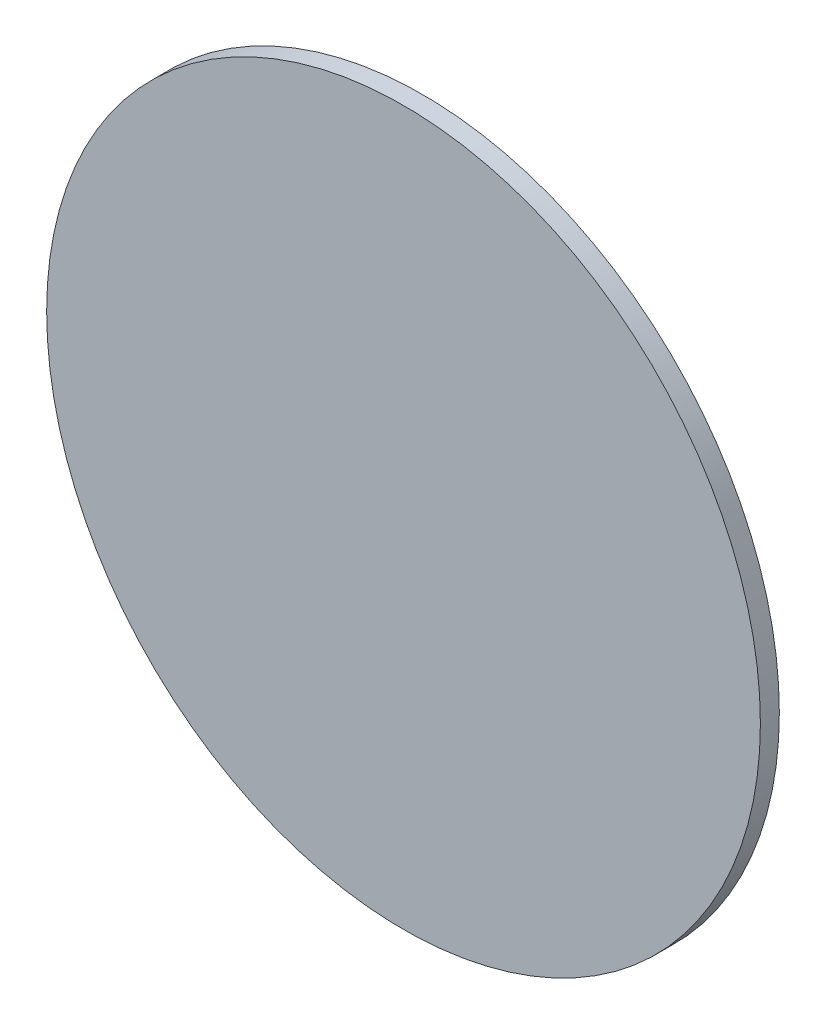
ISO-10303-21;
HEADER;
FILE_DESCRIPTION(('STEP AP214'),'2;1');
FILE_NAME('part.step','',(''),(''),'','','');
FILE_SCHEMA(('AUTOMOTIVE_DESIGN { 1 0 10303 214 1 1 1 1 }'));
ENDSEC;
DATA;
#1=APPLICATION_CONTEXT('core data for automotive mechanical design processes');
#2=APPLICATION_PROTOCOL_DEFINITION('international standard','automotive_design',2000,#1);
#3=PRODUCT_CONTEXT('',#1,'mechanical');
#4=PRODUCT('Part','Part','',(#3));
#5=PRODUCT_RELATED_PRODUCT_CATEGORY('part','',(#4));
#6=PRODUCT_DEFINITION_FORMATION('','',#4);
#7=PRODUCT_DEFINITION_CONTEXT('part definition',#1,'design');
#8=PRODUCT_DEFINITION('design','',#6,#7);
#9=PRODUCT_DEFINITION_SHAPE('','',#8);
#10=(LENGTH_UNIT() NAMED_UNIT(*) SI_UNIT(.MILLI.,.METRE.));
#11=(NAMED_UNIT(*) PLANE_ANGLE_UNIT() SI_UNIT($,.RADIAN.));
#12=(NAMED_UNIT(*) SI_UNIT($,.STERADIAN.) SOLID_ANGLE_UNIT());
#13=UNCERTAINTY_MEASURE_WITH_UNIT(LENGTH_MEASURE(1.E-05),#10,'distance_accuracy_value','');
#14=(GEOMETRIC_REPRESENTATION_CONTEXT(3) GLOBAL_UNCERTAINTY_ASSIGNED_CONTEXT((#13)) GLOBAL_UNIT_ASSIGNED_CONTEXT((#10,
#11,#12)) REPRESENTATION_CONTEXT('',''));
#15=CARTESIAN_POINT('',(0.,0.,0.));
#16=DIRECTION('',(0.,0.,1.));
#17=DIRECTION('',(1.,0.,0.));
#18=AXIS2_PLACEMENT_3D('',#15,#16,#17);
#19=CARTESIAN_POINT('',(0.,0.,6.8));
#20=DIRECTION('',(0.,0.,-1.));
#21=DIRECTION('',(-1.,0.,0.));
#22=AXIS2_PLACEMENT_3D('',#19,#20,#21);
#23=CYLINDRICAL_SURFACE('',#22,128.);
#24=CARTESIAN_POINT('',(0.,0.,6.8));
#25=DIRECTION('',(0.,0.,1.));
#26=DIRECTION('',(1.,0.,0.));
#27=AXIS2_PLACEMENT_3D('',#24,#25,#26);
#28=CIRCLE('',#27,128.);
#29=CARTESIAN_POINT('',(128.,0.,6.8));
#30=VERTEX_POINT('',#29);
#31=EDGE_CURVE('E10',#30,#30,#28,.T.);
#32=ORIENTED_EDGE('',*,*,#31,.F.);
#33=EDGE_LOOP('',(#32));
#34=FACE_BOUND('',#33,.T.);
#35=CARTESIAN_POINT('',(0.,0.,0.));
#36=DIRECTION('',(0.,0.,1.));
#37=DIRECTION('',(1.,0.,0.));
#38=AXIS2_PLACEMENT_3D('',#35,#36,#37);
#39=CIRCLE('',#38,128.);
#40=CARTESIAN_POINT('',(128.,0.,0.));
#41=VERTEX_POINT('',#40);
#42=EDGE_CURVE('E36',#41,#41,#39,.T.);
#43=ORIENTED_EDGE('',*,*,#42,.T.);
#44=EDGE_LOOP('',(#43));
#45=FACE_BOUND('',#44,.T.);
#46=ADVANCED_FACE('F33',(#34,#45),#23,.T.);
#47=CARTESIAN_POINT('',(0.,0.,6.8));
#48=DIRECTION('',(0.,0.,1.));
#49=DIRECTION('',(1.,0.,0.));
#50=AXIS2_PLACEMENT_3D('',#47,#48,#49);
#51=PLANE('',#50);
#52=ORIENTED_EDGE('',*,*,#31,.T.);
#53=EDGE_LOOP('',(#52));
#54=FACE_BOUND('',#53,.T.);
#55=ADVANCED_FACE('F48',(#54),#51,.T.);
#56=CARTESIAN_POINT('',(0.,0.,0.));
#57=DIRECTION('',(0.,0.,1.));
#58=DIRECTION('',(1.,0.,0.));
#59=AXIS2_PLACEMENT_3D('',#56,#57,#58);
#60=PLANE('',#59);
#61=ORIENTED_EDGE('',*,*,#42,.F.);
#62=EDGE_LOOP('',(#61));
#63=FACE_BOUND('',#62,.T.);
#64=ADVANCED_FACE('F46',(#63),#60,.F.);
#65=CLOSED_SHELL('',(#46,#55,#64));
#66=MANIFOLD_SOLID_BREP('B2',#65);
#67=ADVANCED_BREP_SHAPE_REPRESENTATION('',(#18,#66),#14);
#68=SHAPE_DEFINITION_REPRESENTATION(#9,#67);
ENDSEC;
END-ISO-10303-21;
